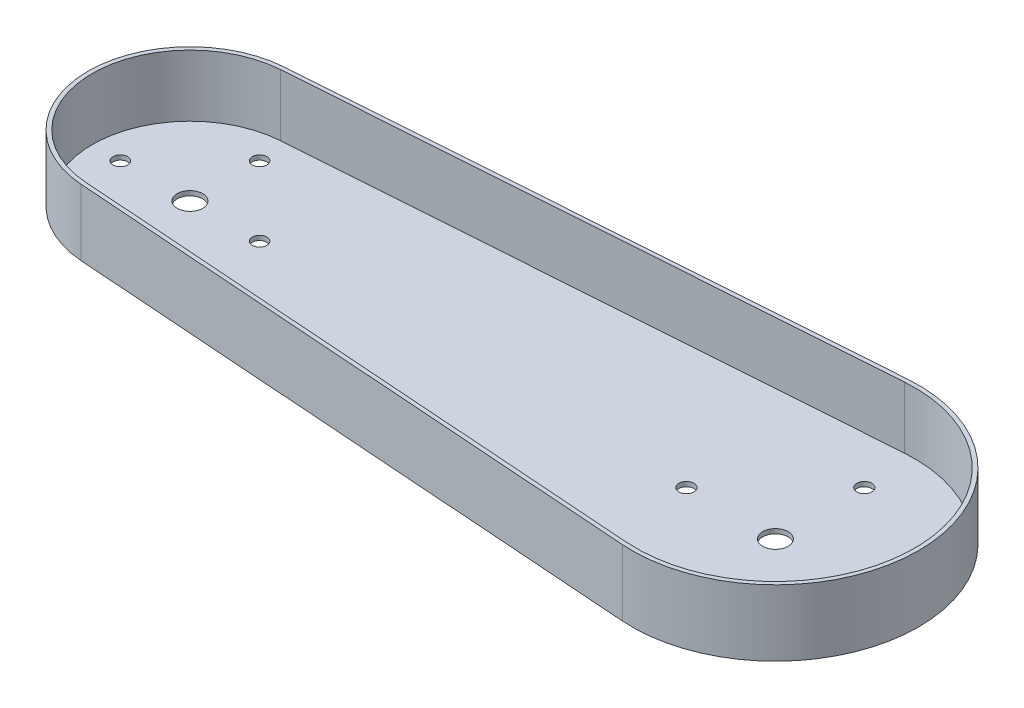
ISO-10303-21;
HEADER;
FILE_DESCRIPTION(('STEP AP214'),'2;1');
FILE_NAME('part.step','',(''),(''),'','','');
FILE_SCHEMA(('AUTOMOTIVE_DESIGN { 1 0 10303 214 1 1 1 1 }'));
ENDSEC;
DATA;
#1=APPLICATION_CONTEXT('core data for automotive mechanical design processes');
#2=APPLICATION_PROTOCOL_DEFINITION('international standard','automotive_design',2000,#1);
#3=PRODUCT_CONTEXT('',#1,'mechanical');
#4=PRODUCT('Part','Part','',(#3));
#5=PRODUCT_RELATED_PRODUCT_CATEGORY('part','',(#4));
#6=PRODUCT_DEFINITION_FORMATION('','',#4);
#7=PRODUCT_DEFINITION_CONTEXT('part definition',#1,'design');
#8=PRODUCT_DEFINITION('design','',#6,#7);
#9=PRODUCT_DEFINITION_SHAPE('','',#8);
#10=(LENGTH_UNIT() NAMED_UNIT(*) SI_UNIT(.MILLI.,.METRE.));
#11=(NAMED_UNIT(*) PLANE_ANGLE_UNIT() SI_UNIT($,.RADIAN.));
#12=(NAMED_UNIT(*) SI_UNIT($,.STERADIAN.) SOLID_ANGLE_UNIT());
#13=UNCERTAINTY_MEASURE_WITH_UNIT(LENGTH_MEASURE(1.E-05),#10,'distance_accuracy_value','');
#14=(GEOMETRIC_REPRESENTATION_CONTEXT(3) GLOBAL_UNCERTAINTY_ASSIGNED_CONTEXT((#13)) GLOBAL_UNIT_ASSIGNED_CONTEXT((#10,
#11,#12)) REPRESENTATION_CONTEXT('',''));
#15=CARTESIAN_POINT('',(0.,0.,0.));
#16=DIRECTION('',(0.,0.,1.));
#17=DIRECTION('',(1.,0.,0.));
#18=AXIS2_PLACEMENT_3D('',#15,#16,#17);
#19=CARTESIAN_POINT('',(230.,26.,-34.95));
#20=DIRECTION('',(0.,-1.,0.));
#21=DIRECTION('',(0.,0.,-1.));
#22=AXIS2_PLACEMENT_3D('',#19,#20,#21);
#23=CYLINDRICAL_SURFACE('',#22,2.95);
#24=CARTESIAN_POINT('',(230.,0.,-34.95));
#25=DIRECTION('',(0.,1.,0.));
#26=DIRECTION('',(0.,0.,1.));
#27=AXIS2_PLACEMENT_3D('',#24,#25,#26);
#28=CIRCLE('',#27,2.95);
#29=CARTESIAN_POINT('',(230.,0.,-32.));
#30=VERTEX_POINT('',#29);
#31=EDGE_CURVE('E224',#30,#30,#28,.T.);
#32=ORIENTED_EDGE('',*,*,#31,.F.);
#33=EDGE_LOOP('',(#32));
#34=FACE_BOUND('',#33,.T.);
#35=CARTESIAN_POINT('',(230.,1.8,-34.95));
#36=DIRECTION('',(0.,1.,0.));
#37=DIRECTION('',(0.,0.,1.));
#38=AXIS2_PLACEMENT_3D('',#35,#36,#37);
#39=CIRCLE('',#38,2.95);
#40=CARTESIAN_POINT('',(230.,1.8,-32.));
#41=VERTEX_POINT('',#40);
#42=EDGE_CURVE('E178',#41,#41,#39,.T.);
#43=ORIENTED_EDGE('',*,*,#42,.T.);
#44=EDGE_LOOP('',(#43));
#45=FACE_BOUND('',#44,.T.);
#46=ADVANCED_FACE('F41',(#34,#45),#23,.F.);
#47=CARTESIAN_POINT('',(264.95,26.,0.));
#48=DIRECTION('',(0.,-1.,0.));
#49=DIRECTION('',(0.,0.,-1.));
#50=AXIS2_PLACEMENT_3D('',#47,#48,#49);
#51=CYLINDRICAL_SURFACE('',#50,2.95000000000002);
#52=CARTESIAN_POINT('',(264.95,0.,0.));
#53=DIRECTION('',(0.,1.,0.));
#54=DIRECTION('',(0.,0.,1.));
#55=AXIS2_PLACEMENT_3D('',#52,#53,#54);
#56=CIRCLE('',#55,2.95000000000002);
#57=CARTESIAN_POINT('',(264.95,0.,2.95000000000002));
#58=VERTEX_POINT('',#57);
#59=EDGE_CURVE('E221',#58,#58,#56,.T.);
#60=ORIENTED_EDGE('',*,*,#59,.F.);
#61=EDGE_LOOP('',(#60));
#62=FACE_BOUND('',#61,.T.);
#63=CARTESIAN_POINT('',(264.95,1.8,0.));
#64=DIRECTION('',(0.,1.,0.));
#65=DIRECTION('',(0.,0.,1.));
#66=AXIS2_PLACEMENT_3D('',#63,#64,#65);
#67=CIRCLE('',#66,2.95000000000002);
#68=CARTESIAN_POINT('',(264.95,1.8,2.95000000000002));
#69=VERTEX_POINT('',#68);
#70=EDGE_CURVE('E175',#69,#69,#67,.T.);
#71=ORIENTED_EDGE('',*,*,#70,.T.);
#72=EDGE_LOOP('',(#71));
#73=FACE_BOUND('',#72,.T.);
#74=ADVANCED_FACE('F256',(#62,#73),#51,.F.);
#75=CARTESIAN_POINT('',(230.,26.,34.95));
#76=DIRECTION('',(0.,-1.,0.));
#77=DIRECTION('',(0.,0.,-1.));
#78=AXIS2_PLACEMENT_3D('',#75,#76,#77);
#79=CYLINDRICAL_SURFACE('',#78,2.95);
#80=CARTESIAN_POINT('',(230.,0.,34.95));
#81=DIRECTION('',(0.,1.,0.));
#82=DIRECTION('',(0.,0.,1.));
#83=AXIS2_PLACEMENT_3D('',#80,#81,#82);
#84=CIRCLE('',#83,2.95);
#85=CARTESIAN_POINT('',(230.,0.,37.9));
#86=VERTEX_POINT('',#85);
#87=EDGE_CURVE('E218',#86,#86,#84,.T.);
#88=ORIENTED_EDGE('',*,*,#87,.F.);
#89=EDGE_LOOP('',(#88));
#90=FACE_BOUND('',#89,.T.);
#91=CARTESIAN_POINT('',(230.,1.8,34.95));
#92=DIRECTION('',(0.,1.,0.));
#93=DIRECTION('',(0.,0.,1.));
#94=AXIS2_PLACEMENT_3D('',#91,#92,#93);
#95=CIRCLE('',#94,2.95);
#96=CARTESIAN_POINT('',(230.,1.8,37.9));
#97=VERTEX_POINT('',#96);
#98=EDGE_CURVE('E172',#97,#97,#95,.T.);
#99=ORIENTED_EDGE('',*,*,#98,.T.);
#100=EDGE_LOOP('',(#99));
#101=FACE_BOUND('',#100,.T.);
#102=ADVANCED_FACE('F262',(#90,#101),#79,.F.);
#103=CARTESIAN_POINT('',(195.05,26.,0.));
#104=DIRECTION('',(0.,-1.,0.));
#105=DIRECTION('',(0.,0.,-1.));
#106=AXIS2_PLACEMENT_3D('',#103,#104,#105);
#107=CYLINDRICAL_SURFACE('',#106,2.95);
#108=CARTESIAN_POINT('',(195.05,0.,0.));
#109=DIRECTION('',(0.,1.,0.));
#110=DIRECTION('',(0.,0.,1.));
#111=AXIS2_PLACEMENT_3D('',#108,#109,#110);
#112=CIRCLE('',#111,2.95);
#113=CARTESIAN_POINT('',(195.05,0.,2.95));
#114=VERTEX_POINT('',#113);
#115=EDGE_CURVE('E215',#114,#114,#112,.T.);
#116=ORIENTED_EDGE('',*,*,#115,.F.);
#117=EDGE_LOOP('',(#116));
#118=FACE_BOUND('',#117,.T.);
#119=CARTESIAN_POINT('',(195.05,1.8,0.));
#120=DIRECTION('',(0.,1.,0.));
#121=DIRECTION('',(0.,0.,1.));
#122=AXIS2_PLACEMENT_3D('',#119,#120,#121);
#123=CIRCLE('',#122,2.95);
#124=CARTESIAN_POINT('',(195.05,1.8,2.95));
#125=VERTEX_POINT('',#124);
#126=EDGE_CURVE('E169',#125,#125,#123,.T.);
#127=ORIENTED_EDGE('',*,*,#126,.T.);
#128=EDGE_LOOP('',(#127));
#129=FACE_BOUND('',#128,.T.);
#130=ADVANCED_FACE('F272',(#118,#129),#107,.F.);
#131=CARTESIAN_POINT('',(0.,26.,0.));
#132=DIRECTION('',(0.,-1.,0.));
#133=DIRECTION('',(0.,0.,-1.));
#134=AXIS2_PLACEMENT_3D('',#131,#132,#133);
#135=CYLINDRICAL_SURFACE('',#134,5.);
#136=CARTESIAN_POINT('',(0.,0.,0.));
#137=DIRECTION('',(0.,1.,0.));
#138=DIRECTION('',(0.,0.,1.));
#139=AXIS2_PLACEMENT_3D('',#136,#137,#138);
#140=CIRCLE('',#139,5.);
#141=CARTESIAN_POINT('',(0.,0.,5.));
#142=VERTEX_POINT('',#141);
#143=EDGE_CURVE('E212',#142,#142,#140,.T.);
#144=ORIENTED_EDGE('',*,*,#143,.F.);
#145=EDGE_LOOP('',(#144));
#146=FACE_BOUND('',#145,.T.);
#147=CARTESIAN_POINT('',(0.,1.8,0.));
#148=DIRECTION('',(0.,1.,0.));
#149=DIRECTION('',(0.,0.,1.));
#150=AXIS2_PLACEMENT_3D('',#147,#148,#149);
#151=CIRCLE('',#150,5.);
#152=CARTESIAN_POINT('',(0.,1.8,5.));
#153=VERTEX_POINT('',#152);
#154=EDGE_CURVE('E166',#153,#153,#151,.T.);
#155=ORIENTED_EDGE('',*,*,#154,.T.);
#156=EDGE_LOOP('',(#155));
#157=FACE_BOUND('',#156,.T.);
#158=ADVANCED_FACE('F276',(#146,#157),#135,.F.);
#159=CARTESIAN_POINT('',(0.,26.,-27.35));
#160=DIRECTION('',(0.,-1.,0.));
#161=DIRECTION('',(0.,0.,-1.));
#162=AXIS2_PLACEMENT_3D('',#159,#160,#161);
#163=CYLINDRICAL_SURFACE('',#162,2.85);
#164=CARTESIAN_POINT('',(0.,0.,-27.35));
#165=DIRECTION('',(0.,1.,0.));
#166=DIRECTION('',(0.,0.,1.));
#167=AXIS2_PLACEMENT_3D('',#164,#165,#166);
#168=CIRCLE('',#167,2.85);
#169=CARTESIAN_POINT('',(0.,0.,-24.5));
#170=VERTEX_POINT('',#169);
#171=EDGE_CURVE('E209',#170,#170,#168,.T.);
#172=ORIENTED_EDGE('',*,*,#171,.F.);
#173=EDGE_LOOP('',(#172));
#174=FACE_BOUND('',#173,.T.);
#175=CARTESIAN_POINT('',(0.,1.8,-27.35));
#176=DIRECTION('',(0.,1.,0.));
#177=DIRECTION('',(0.,0.,1.));
#178=AXIS2_PLACEMENT_3D('',#175,#176,#177);
#179=CIRCLE('',#178,2.85);
#180=CARTESIAN_POINT('',(0.,1.8,-24.5));
#181=VERTEX_POINT('',#180);
#182=EDGE_CURVE('E163',#181,#181,#179,.T.);
#183=ORIENTED_EDGE('',*,*,#182,.T.);
#184=EDGE_LOOP('',(#183));
#185=FACE_BOUND('',#184,.T.);
#186=ADVANCED_FACE('F280',(#174,#185),#163,.F.);
#187=CARTESIAN_POINT('',(27.35,26.,0.));
#188=DIRECTION('',(0.,-1.,0.));
#189=DIRECTION('',(0.,0.,-1.));
#190=AXIS2_PLACEMENT_3D('',#187,#188,#189);
#191=CYLINDRICAL_SURFACE('',#190,2.85);
#192=CARTESIAN_POINT('',(27.35,0.,0.));
#193=DIRECTION('',(0.,1.,0.));
#194=DIRECTION('',(0.,0.,1.));
#195=AXIS2_PLACEMENT_3D('',#192,#193,#194);
#196=CIRCLE('',#195,2.85);
#197=CARTESIAN_POINT('',(27.35,0.,2.85));
#198=VERTEX_POINT('',#197);
#199=EDGE_CURVE('E206',#198,#198,#196,.T.);
#200=ORIENTED_EDGE('',*,*,#199,.F.);
#201=EDGE_LOOP('',(#200));
#202=FACE_BOUND('',#201,.T.);
#203=CARTESIAN_POINT('',(27.35,1.8,0.));
#204=DIRECTION('',(0.,1.,0.));
#205=DIRECTION('',(0.,0.,1.));
#206=AXIS2_PLACEMENT_3D('',#203,#204,#205);
#207=CIRCLE('',#206,2.85);
#208=CARTESIAN_POINT('',(27.35,1.8,2.85));
#209=VERTEX_POINT('',#208);
#210=EDGE_CURVE('E160',#209,#209,#207,.T.);
#211=ORIENTED_EDGE('',*,*,#210,.T.);
#212=EDGE_LOOP('',(#211));
#213=FACE_BOUND('',#212,.T.);
#214=ADVANCED_FACE('F284',(#202,#213),#191,.F.);
#215=CARTESIAN_POINT('',(0.,26.,27.35));
#216=DIRECTION('',(0.,-1.,0.));
#217=DIRECTION('',(0.,0.,-1.));
#218=AXIS2_PLACEMENT_3D('',#215,#216,#217);
#219=CYLINDRICAL_SURFACE('',#218,2.85);
#220=CARTESIAN_POINT('',(0.,0.,27.35));
#221=DIRECTION('',(0.,1.,0.));
#222=DIRECTION('',(0.,0.,1.));
#223=AXIS2_PLACEMENT_3D('',#220,#221,#222);
#224=CIRCLE('',#223,2.85);
#225=CARTESIAN_POINT('',(0.,0.,30.2));
#226=VERTEX_POINT('',#225);
#227=EDGE_CURVE('E203',#226,#226,#224,.T.);
#228=ORIENTED_EDGE('',*,*,#227,.F.);
#229=EDGE_LOOP('',(#228));
#230=FACE_BOUND('',#229,.T.);
#231=CARTESIAN_POINT('',(0.,1.8,27.35));
#232=DIRECTION('',(0.,1.,0.));
#233=DIRECTION('',(0.,0.,1.));
#234=AXIS2_PLACEMENT_3D('',#231,#232,#233);
#235=CIRCLE('',#234,2.85);
#236=CARTESIAN_POINT('',(0.,1.8,30.2));
#237=VERTEX_POINT('',#236);
#238=EDGE_CURVE('E157',#237,#237,#235,.T.);
#239=ORIENTED_EDGE('',*,*,#238,.T.);
#240=EDGE_LOOP('',(#239));
#241=FACE_BOUND('',#240,.T.);
#242=ADVANCED_FACE('F288',(#230,#241),#219,.F.);
#243=CARTESIAN_POINT('',(-27.35,26.,0.));
#244=DIRECTION('',(0.,-1.,0.));
#245=DIRECTION('',(0.,0.,-1.));
#246=AXIS2_PLACEMENT_3D('',#243,#244,#245);
#247=CYLINDRICAL_SURFACE('',#246,2.85);
#248=CARTESIAN_POINT('',(-27.35,0.,0.));
#249=DIRECTION('',(0.,1.,0.));
#250=DIRECTION('',(0.,0.,1.));
#251=AXIS2_PLACEMENT_3D('',#248,#249,#250);
#252=CIRCLE('',#251,2.85);
#253=CARTESIAN_POINT('',(-27.35,0.,2.85));
#254=VERTEX_POINT('',#253);
#255=EDGE_CURVE('E200',#254,#254,#252,.T.);
#256=ORIENTED_EDGE('',*,*,#255,.F.);
#257=EDGE_LOOP('',(#256));
#258=FACE_BOUND('',#257,.T.);
#259=CARTESIAN_POINT('',(-27.35,1.8,0.));
#260=DIRECTION('',(0.,1.,0.));
#261=DIRECTION('',(0.,0.,1.));
#262=AXIS2_PLACEMENT_3D('',#259,#260,#261);
#263=CIRCLE('',#262,2.85);
#264=CARTESIAN_POINT('',(-27.35,1.8,2.85));
#265=VERTEX_POINT('',#264);
#266=EDGE_CURVE('E154',#265,#265,#263,.T.);
#267=ORIENTED_EDGE('',*,*,#266,.T.);
#268=EDGE_LOOP('',(#267));
#269=FACE_BOUND('',#268,.T.);
#270=ADVANCED_FACE('F292',(#258,#269),#247,.F.);
#271=CARTESIAN_POINT('',(230.,26.,0.));
#272=DIRECTION('',(0.,-1.,0.));
#273=DIRECTION('',(0.,0.,-1.));
#274=AXIS2_PLACEMENT_3D('',#271,#272,#273);
#275=CYLINDRICAL_SURFACE('',#274,5.00000000000002);
#276=CARTESIAN_POINT('',(230.,0.,0.));
#277=DIRECTION('',(0.,1.,0.));
#278=DIRECTION('',(0.,0.,1.));
#279=AXIS2_PLACEMENT_3D('',#276,#277,#278);
#280=CIRCLE('',#279,5.00000000000002);
#281=CARTESIAN_POINT('',(230.,0.,5.00000000000002));
#282=VERTEX_POINT('',#281);
#283=EDGE_CURVE('E184',#282,#282,#280,.T.);
#284=ORIENTED_EDGE('',*,*,#283,.F.);
#285=EDGE_LOOP('',(#284));
#286=FACE_BOUND('',#285,.T.);
#287=CARTESIAN_POINT('',(230.,1.8,0.));
#288=DIRECTION('',(0.,1.,0.));
#289=DIRECTION('',(0.,0.,1.));
#290=AXIS2_PLACEMENT_3D('',#287,#288,#289);
#291=CIRCLE('',#290,5.00000000000002);
#292=CARTESIAN_POINT('',(230.,1.8,5.00000000000002));
#293=VERTEX_POINT('',#292);
#294=EDGE_CURVE('E45',#293,#293,#291,.T.);
#295=ORIENTED_EDGE('',*,*,#294,.T.);
#296=EDGE_LOOP('',(#295));
#297=FACE_BOUND('',#296,.T.);
#298=ADVANCED_FACE('F268',(#286,#297),#275,.F.);
#299=CARTESIAN_POINT('',(-2.83478260869566,26.,39.8994236494894));
#300=DIRECTION('',(0.0708695652173914,0.,-0.997485591237236));
#301=DIRECTION('',(-0.997485591237236,0.,-0.0708695652173914));
#302=AXIS2_PLACEMENT_3D('',#299,#300,#301);
#303=PLANE('',#302);
#304=DIRECTION('',(0.997485591237236,0.,0.0708695652173914));
#305=VECTOR('',#304,1.);
#306=CARTESIAN_POINT('',(-2.83478260869566,0.,39.8994236494894));
#307=LINE('',#306,#305);
#308=CARTESIAN_POINT('',(-2.83478260869565,0.,39.8994236494894));
#309=VERTEX_POINT('',#308);
#310=CARTESIAN_POINT('',(226.010043478261,0.,56.1584387866564));
#311=VERTEX_POINT('',#310);
#312=EDGE_CURVE('E181',#309,#311,#307,.T.);
#313=ORIENTED_EDGE('',*,*,#312,.T.);
#314=DIRECTION('',(0.,-1.,0.));
#315=VECTOR('',#314,1.);
#316=CARTESIAN_POINT('',(226.010043478261,26.,56.1584387866564));
#317=LINE('',#316,#315);
#318=CARTESIAN_POINT('',(226.010043478261,26.,56.1584387866564));
#319=VERTEX_POINT('',#318);
#320=EDGE_CURVE('E11',#319,#311,#317,.T.);
#321=ORIENTED_EDGE('',*,*,#320,.F.);
#322=DIRECTION('',(0.997485591237236,0.,0.0708695652173914));
#323=VECTOR('',#322,1.);
#324=CARTESIAN_POINT('',(-2.83478260869566,26.,39.8994236494894));
#325=LINE('',#324,#323);
#326=CARTESIAN_POINT('',(-2.83478260869565,26.,39.8994236494894));
#327=VERTEX_POINT('',#326);
#328=EDGE_CURVE('E182',#327,#319,#325,.T.);
#329=ORIENTED_EDGE('',*,*,#328,.F.);
#330=DIRECTION('',(0.,-1.,0.));
#331=VECTOR('',#330,1.);
#332=CARTESIAN_POINT('',(-2.83478260869565,26.,39.8994236494894));
#333=LINE('',#332,#331);
#334=EDGE_CURVE('E190',#327,#309,#333,.T.);
#335=ORIENTED_EDGE('',*,*,#334,.T.);
#336=EDGE_LOOP('',(#313,#321,#329,#335));
#337=FACE_BOUND('',#336,.T.);
#338=ADVANCED_FACE('F43',(#337),#303,.F.);
#339=CARTESIAN_POINT('',(230.,26.,0.));
#340=DIRECTION('',(0.,-1.,0.));
#341=DIRECTION('',(0.,0.,-1.));
#342=AXIS2_PLACEMENT_3D('',#339,#340,#341);
#343=CYLINDRICAL_SURFACE('',#342,56.3);
#344=CARTESIAN_POINT('',(230.,0.,0.));
#345=DIRECTION('',(0.,1.,0.));
#346=DIRECTION('',(0.,0.,1.));
#347=AXIS2_PLACEMENT_3D('',#344,#345,#346);
#348=CIRCLE('',#347,56.3);
#349=CARTESIAN_POINT('',(226.010043478261,0.,-56.1584387866564));
#350=VERTEX_POINT('',#349);
#351=EDGE_CURVE('E193',#311,#350,#348,.T.);
#352=ORIENTED_EDGE('',*,*,#351,.T.);
#353=DIRECTION('',(0.,-1.,0.));
#354=VECTOR('',#353,1.);
#355=CARTESIAN_POINT('',(226.010043478261,26.,-56.1584387866564));
#356=LINE('',#355,#354);
#357=CARTESIAN_POINT('',(226.010043478261,26.,-56.1584387866564));
#358=VERTEX_POINT('',#357);
#359=EDGE_CURVE('E50',#358,#350,#356,.T.);
#360=ORIENTED_EDGE('',*,*,#359,.F.);
#361=CARTESIAN_POINT('',(230.,26.,0.));
#362=DIRECTION('',(0.,1.,0.));
#363=DIRECTION('',(0.,0.,1.));
#364=AXIS2_PLACEMENT_3D('',#361,#362,#363);
#365=CIRCLE('',#364,56.3);
#366=EDGE_CURVE('E94',#319,#358,#365,.T.);
#367=ORIENTED_EDGE('',*,*,#366,.F.);
#368=ORIENTED_EDGE('',*,*,#320,.T.);
#369=EDGE_LOOP('',(#352,#360,#367,#368));
#370=FACE_BOUND('',#369,.T.);
#371=ADVANCED_FACE('F235',(#370),#343,.T.);
#372=CARTESIAN_POINT('',(-2.83478260869565,26.,-39.8994236494894));
#373=DIRECTION('',(-0.0708695652173913,0.,-0.997485591237236));
#374=DIRECTION('',(-0.997485591237236,0.,0.0708695652173914));
#375=AXIS2_PLACEMENT_3D('',#372,#373,#374);
#376=PLANE('',#375);
#377=DIRECTION('',(0.997485591237236,0.,-0.0708695652173914));
#378=VECTOR('',#377,1.);
#379=CARTESIAN_POINT('',(-2.83478260869565,0.,-39.8994236494894));
#380=LINE('',#379,#378);
#381=CARTESIAN_POINT('',(-2.83478260869565,0.,-39.8994236494894));
#382=VERTEX_POINT('',#381);
#383=EDGE_CURVE('E196',#382,#350,#380,.T.);
#384=ORIENTED_EDGE('',*,*,#383,.F.);
#385=DIRECTION('',(0.,-1.,0.));
#386=VECTOR('',#385,1.);
#387=CARTESIAN_POINT('',(-2.83478260869565,26.,-39.8994236494894));
#388=LINE('',#387,#386);
#389=CARTESIAN_POINT('',(-2.83478260869565,26.,-39.8994236494894));
#390=VERTEX_POINT('',#389);
#391=EDGE_CURVE('E230',#390,#382,#388,.T.);
#392=ORIENTED_EDGE('',*,*,#391,.F.);
#393=DIRECTION('',(0.997485591237236,0.,-0.0708695652173914));
#394=VECTOR('',#393,1.);
#395=CARTESIAN_POINT('',(-2.83478260869565,26.,-39.8994236494894));
#396=LINE('',#395,#394);
#397=EDGE_CURVE('E186',#390,#358,#396,.T.);
#398=ORIENTED_EDGE('',*,*,#397,.T.);
#399=ORIENTED_EDGE('',*,*,#359,.T.);
#400=EDGE_LOOP('',(#384,#392,#398,#399));
#401=FACE_BOUND('',#400,.T.);
#402=ADVANCED_FACE('F234',(#401),#376,.T.);
#403=CARTESIAN_POINT('',(0.,26.,0.));
#404=DIRECTION('',(0.,-1.,0.));
#405=DIRECTION('',(0.,0.,-1.));
#406=AXIS2_PLACEMENT_3D('',#403,#404,#405);
#407=CYLINDRICAL_SURFACE('',#406,40.);
#408=CARTESIAN_POINT('',(0.,0.,0.));
#409=DIRECTION('',(0.,1.,0.));
#410=DIRECTION('',(0.,0.,1.));
#411=AXIS2_PLACEMENT_3D('',#408,#409,#410);
#412=CIRCLE('',#411,40.);
#413=EDGE_CURVE('E87',#382,#309,#412,.T.);
#414=ORIENTED_EDGE('',*,*,#413,.T.);
#415=ORIENTED_EDGE('',*,*,#334,.F.);
#416=CARTESIAN_POINT('',(0.,26.,0.));
#417=DIRECTION('',(0.,1.,0.));
#418=DIRECTION('',(0.,0.,1.));
#419=AXIS2_PLACEMENT_3D('',#416,#417,#418);
#420=CIRCLE('',#419,40.);
#421=EDGE_CURVE('E66',#390,#327,#420,.T.);
#422=ORIENTED_EDGE('',*,*,#421,.F.);
#423=ORIENTED_EDGE('',*,*,#391,.T.);
#424=EDGE_LOOP('',(#414,#415,#422,#423));
#425=FACE_BOUND('',#424,.T.);
#426=ADVANCED_FACE('F243',(#425),#407,.T.);
#427=CARTESIAN_POINT('',(0.,26.,0.));
#428=DIRECTION('',(0.,1.,0.));
#429=DIRECTION('',(0.,0.,1.));
#430=AXIS2_PLACEMENT_3D('',#427,#428,#429);
#431=PLANE('',#430);
#432=CARTESIAN_POINT('',(230.,26.,0.));
#433=DIRECTION('',(0.,1.,0.));
#434=DIRECTION('',(0.,0.,1.));
#435=AXIS2_PLACEMENT_3D('',#432,#433,#434);
#436=CIRCLE('',#435,54.7);
#437=CARTESIAN_POINT('',(226.123434782609,26.,54.5624618406768));
#438=VERTEX_POINT('',#437);
#439=CARTESIAN_POINT('',(226.123434782609,26.,-54.5624618406768));
#440=VERTEX_POINT('',#439);
#441=EDGE_CURVE('E57',#438,#440,#436,.T.);
#442=ORIENTED_EDGE('',*,*,#441,.F.);
#443=DIRECTION('',(0.997485591237236,0.,0.0708695652173913));
#444=VECTOR('',#443,1.);
#445=CARTESIAN_POINT('',(-2.72139130434781,26.,38.3034467035099));
#446=LINE('',#445,#444);
#447=CARTESIAN_POINT('',(-2.72139130434781,26.,38.3034467035099));
#448=VERTEX_POINT('',#447);
#449=EDGE_CURVE('E136',#448,#438,#446,.T.);
#450=ORIENTED_EDGE('',*,*,#449,.F.);
#451=CARTESIAN_POINT('',(0.,26.,0.));
#452=DIRECTION('',(0.,1.,0.));
#453=DIRECTION('',(0.,0.,1.));
#454=AXIS2_PLACEMENT_3D('',#451,#452,#453);
#455=CIRCLE('',#454,38.4);
#456=CARTESIAN_POINT('',(-2.72139130434783,26.,-38.3034467035099));
#457=VERTEX_POINT('',#456);
#458=EDGE_CURVE('E139',#457,#448,#455,.T.);
#459=ORIENTED_EDGE('',*,*,#458,.F.);
#460=DIRECTION('',(-0.997485591237236,0.,0.0708695652173913));
#461=VECTOR('',#460,1.);
#462=CARTESIAN_POINT('',(226.123434782609,26.,-54.5624618406768));
#463=LINE('',#462,#461);
#464=EDGE_CURVE('E145',#440,#457,#463,.T.);
#465=ORIENTED_EDGE('',*,*,#464,.F.);
#466=EDGE_LOOP('',(#442,#450,#459,#465));
#467=FACE_BOUND('',#466,.T.);
#468=ORIENTED_EDGE('',*,*,#328,.T.);
#469=ORIENTED_EDGE('',*,*,#366,.T.);
#470=ORIENTED_EDGE('',*,*,#397,.F.);
#471=ORIENTED_EDGE('',*,*,#421,.T.);
#472=EDGE_LOOP('',(#468,#469,#470,#471));
#473=FACE_BOUND('',#472,.T.);
#474=ADVANCED_FACE('F244',(#467,#473),#431,.T.);
#475=CARTESIAN_POINT('',(0.,0.,0.));
#476=DIRECTION('',(0.,1.,0.));
#477=DIRECTION('',(0.,0.,1.));
#478=AXIS2_PLACEMENT_3D('',#475,#476,#477);
#479=PLANE('',#478);
#480=ORIENTED_EDGE('',*,*,#312,.F.);
#481=ORIENTED_EDGE('',*,*,#413,.F.);
#482=ORIENTED_EDGE('',*,*,#383,.T.);
#483=ORIENTED_EDGE('',*,*,#351,.F.);
#484=EDGE_LOOP('',(#480,#481,#482,#483));
#485=FACE_BOUND('',#484,.T.);
#486=ORIENTED_EDGE('',*,*,#255,.T.);
#487=EDGE_LOOP('',(#486));
#488=FACE_BOUND('',#487,.T.);
#489=ORIENTED_EDGE('',*,*,#227,.T.);
#490=EDGE_LOOP('',(#489));
#491=FACE_BOUND('',#490,.T.);
#492=ORIENTED_EDGE('',*,*,#199,.T.);
#493=EDGE_LOOP('',(#492));
#494=FACE_BOUND('',#493,.T.);
#495=ORIENTED_EDGE('',*,*,#171,.T.);
#496=EDGE_LOOP('',(#495));
#497=FACE_BOUND('',#496,.T.);
#498=ORIENTED_EDGE('',*,*,#143,.T.);
#499=EDGE_LOOP('',(#498));
#500=FACE_BOUND('',#499,.T.);
#501=ORIENTED_EDGE('',*,*,#115,.T.);
#502=EDGE_LOOP('',(#501));
#503=FACE_BOUND('',#502,.T.);
#504=ORIENTED_EDGE('',*,*,#87,.T.);
#505=EDGE_LOOP('',(#504));
#506=FACE_BOUND('',#505,.T.);
#507=ORIENTED_EDGE('',*,*,#59,.T.);
#508=EDGE_LOOP('',(#507));
#509=FACE_BOUND('',#508,.T.);
#510=ORIENTED_EDGE('',*,*,#31,.T.);
#511=EDGE_LOOP('',(#510));
#512=FACE_BOUND('',#511,.T.);
#513=ORIENTED_EDGE('',*,*,#283,.T.);
#514=EDGE_LOOP('',(#513));
#515=FACE_BOUND('',#514,.T.);
#516=ADVANCED_FACE('F239',(#485,#488,#491,#494,#497,#500,#503,#506,#509,#512,#515),#479,.F.);
#517=CARTESIAN_POINT('',(230.,1.8,0.));
#518=DIRECTION('',(0.,1.,0.));
#519=DIRECTION('',(0.,0.,1.));
#520=AXIS2_PLACEMENT_3D('',#517,#518,#519);
#521=CYLINDRICAL_SURFACE('',#520,54.7);
#522=ORIENTED_EDGE('',*,*,#441,.T.);
#523=DIRECTION('',(0.,1.,0.));
#524=VECTOR('',#523,1.);
#525=CARTESIAN_POINT('',(226.123434782609,1.8,-54.5624618406768));
#526=LINE('',#525,#524);
#527=CARTESIAN_POINT('',(226.123434782609,1.8,-54.5624618406768));
#528=VERTEX_POINT('',#527);
#529=EDGE_CURVE('E114',#528,#440,#526,.T.);
#530=ORIENTED_EDGE('',*,*,#529,.F.);
#531=CARTESIAN_POINT('',(230.,1.8,0.));
#532=DIRECTION('',(0.,1.,0.));
#533=DIRECTION('',(0.,0.,1.));
#534=AXIS2_PLACEMENT_3D('',#531,#532,#533);
#535=CIRCLE('',#534,54.7);
#536=CARTESIAN_POINT('',(226.123434782609,1.8,54.5624618406768));
#537=VERTEX_POINT('',#536);
#538=EDGE_CURVE('E118',#537,#528,#535,.T.);
#539=ORIENTED_EDGE('',*,*,#538,.F.);
#540=DIRECTION('',(0.,1.,0.));
#541=VECTOR('',#540,1.);
#542=CARTESIAN_POINT('',(226.123434782609,1.8,54.5624618406768));
#543=LINE('',#542,#541);
#544=EDGE_CURVE('E149',#537,#438,#543,.T.);
#545=ORIENTED_EDGE('',*,*,#544,.T.);
#546=EDGE_LOOP('',(#522,#530,#539,#545));
#547=FACE_BOUND('',#546,.T.);
#548=ADVANCED_FACE('F116',(#547),#521,.F.);
#549=CARTESIAN_POINT('',(-2.72139130434781,1.8,38.3034467035099));
#550=DIRECTION('',(-0.0708695652173913,0.,0.997485591237236));
#551=DIRECTION('',(0.997485591237236,0.,0.0708695652173913));
#552=AXIS2_PLACEMENT_3D('',#549,#550,#551);
#553=PLANE('',#552);
#554=ORIENTED_EDGE('',*,*,#449,.T.);
#555=ORIENTED_EDGE('',*,*,#544,.F.);
#556=DIRECTION('',(0.997485591237236,0.,0.0708695652173913));
#557=VECTOR('',#556,1.);
#558=CARTESIAN_POINT('',(-2.72139130434781,1.8,38.3034467035099));
#559=LINE('',#558,#557);
#560=CARTESIAN_POINT('',(-2.72139130434781,1.8,38.3034467035099));
#561=VERTEX_POINT('',#560);
#562=EDGE_CURVE('E124',#561,#537,#559,.T.);
#563=ORIENTED_EDGE('',*,*,#562,.F.);
#564=DIRECTION('',(0.,1.,0.));
#565=VECTOR('',#564,1.);
#566=CARTESIAN_POINT('',(-2.72139130434781,1.8,38.3034467035099));
#567=LINE('',#566,#565);
#568=EDGE_CURVE('E151',#561,#448,#567,.T.);
#569=ORIENTED_EDGE('',*,*,#568,.T.);
#570=EDGE_LOOP('',(#554,#555,#563,#569));
#571=FACE_BOUND('',#570,.T.);
#572=ADVANCED_FACE('F324',(#571),#553,.F.);
#573=CARTESIAN_POINT('',(0.,1.8,0.));
#574=DIRECTION('',(0.,1.,0.));
#575=DIRECTION('',(0.,0.,1.));
#576=AXIS2_PLACEMENT_3D('',#573,#574,#575);
#577=CYLINDRICAL_SURFACE('',#576,38.4);
#578=ORIENTED_EDGE('',*,*,#458,.T.);
#579=ORIENTED_EDGE('',*,*,#568,.F.);
#580=CARTESIAN_POINT('',(0.,1.8,0.));
#581=DIRECTION('',(0.,1.,0.));
#582=DIRECTION('',(0.,0.,1.));
#583=AXIS2_PLACEMENT_3D('',#580,#581,#582);
#584=CIRCLE('',#583,38.4);
#585=CARTESIAN_POINT('',(-2.72139130434783,1.8,-38.3034467035099));
#586=VERTEX_POINT('',#585);
#587=EDGE_CURVE('E132',#586,#561,#584,.T.);
#588=ORIENTED_EDGE('',*,*,#587,.F.);
#589=DIRECTION('',(0.,1.,0.));
#590=VECTOR('',#589,1.);
#591=CARTESIAN_POINT('',(-2.72139130434783,1.8,-38.3034467035099));
#592=LINE('',#591,#590);
#593=EDGE_CURVE('E123',#586,#457,#592,.T.);
#594=ORIENTED_EDGE('',*,*,#593,.T.);
#595=EDGE_LOOP('',(#578,#579,#588,#594));
#596=FACE_BOUND('',#595,.T.);
#597=ADVANCED_FACE('F319',(#596),#577,.F.);
#598=CARTESIAN_POINT('',(226.123434782609,1.8,-54.5624618406768));
#599=DIRECTION('',(-0.0708695652173913,0.,-0.997485591237236));
#600=DIRECTION('',(-0.997485591237236,0.,0.0708695652173914));
#601=AXIS2_PLACEMENT_3D('',#598,#599,#600);
#602=PLANE('',#601);
#603=ORIENTED_EDGE('',*,*,#464,.T.);
#604=ORIENTED_EDGE('',*,*,#593,.F.);
#605=DIRECTION('',(-0.997485591237236,0.,0.0708695652173913));
#606=VECTOR('',#605,1.);
#607=CARTESIAN_POINT('',(226.123434782609,1.8,-54.5624618406768));
#608=LINE('',#607,#606);
#609=EDGE_CURVE('E127',#528,#586,#608,.T.);
#610=ORIENTED_EDGE('',*,*,#609,.F.);
#611=ORIENTED_EDGE('',*,*,#529,.T.);
#612=EDGE_LOOP('',(#603,#604,#610,#611));
#613=FACE_BOUND('',#612,.T.);
#614=ADVANCED_FACE('F128',(#613),#602,.F.);
#615=CARTESIAN_POINT('',(230.,1.8,0.));
#616=DIRECTION('',(0.,1.,0.));
#617=DIRECTION('',(0.,0.,1.));
#618=AXIS2_PLACEMENT_3D('',#615,#616,#617);
#619=PLANE('',#618);
#620=ORIENTED_EDGE('',*,*,#42,.F.);
#621=EDGE_LOOP('',(#620));
#622=FACE_BOUND('',#621,.T.);
#623=ORIENTED_EDGE('',*,*,#70,.F.);
#624=EDGE_LOOP('',(#623));
#625=FACE_BOUND('',#624,.T.);
#626=ORIENTED_EDGE('',*,*,#98,.F.);
#627=EDGE_LOOP('',(#626));
#628=FACE_BOUND('',#627,.T.);
#629=ORIENTED_EDGE('',*,*,#126,.F.);
#630=EDGE_LOOP('',(#629));
#631=FACE_BOUND('',#630,.T.);
#632=ORIENTED_EDGE('',*,*,#154,.F.);
#633=EDGE_LOOP('',(#632));
#634=FACE_BOUND('',#633,.T.);
#635=ORIENTED_EDGE('',*,*,#182,.F.);
#636=EDGE_LOOP('',(#635));
#637=FACE_BOUND('',#636,.T.);
#638=ORIENTED_EDGE('',*,*,#210,.F.);
#639=EDGE_LOOP('',(#638));
#640=FACE_BOUND('',#639,.T.);
#641=ORIENTED_EDGE('',*,*,#238,.F.);
#642=EDGE_LOOP('',(#641));
#643=FACE_BOUND('',#642,.T.);
#644=ORIENTED_EDGE('',*,*,#266,.F.);
#645=EDGE_LOOP('',(#644));
#646=FACE_BOUND('',#645,.T.);
#647=ORIENTED_EDGE('',*,*,#294,.F.);
#648=EDGE_LOOP('',(#647));
#649=FACE_BOUND('',#648,.T.);
#650=ORIENTED_EDGE('',*,*,#538,.T.);
#651=ORIENTED_EDGE('',*,*,#609,.T.);
#652=ORIENTED_EDGE('',*,*,#587,.T.);
#653=ORIENTED_EDGE('',*,*,#562,.T.);
#654=EDGE_LOOP('',(#650,#651,#652,#653));
#655=FACE_BOUND('',#654,.T.);
#656=ADVANCED_FACE('F134',(#622,#625,#628,#631,#634,#637,#640,#643,#646,#649,#655),#619,.T.);
#657=CLOSED_SHELL('',(#46,#74,#102,#130,#158,#186,#214,#242,#270,#298,#338,#371,#402,#426,#474,
#516,#548,#572,#597,#614,#656));
#658=MANIFOLD_SOLID_BREP('B2',#657);
#659=ADVANCED_BREP_SHAPE_REPRESENTATION('',(#18,#658),#14);
#660=SHAPE_DEFINITION_REPRESENTATION(#9,#659);
ENDSEC;
END-ISO-10303-21;
